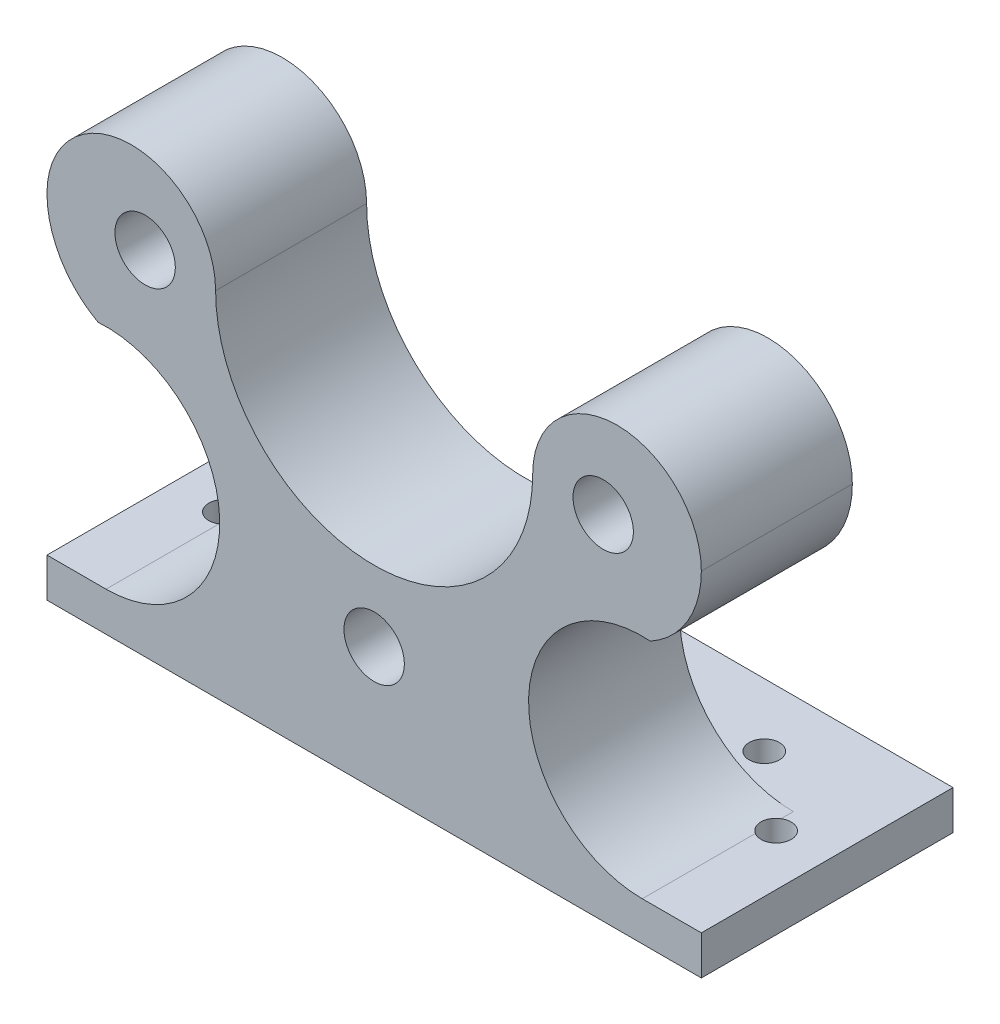
ISO-10303-21;
HEADER;
FILE_DESCRIPTION(('STEP AP214'),'2;1');
FILE_NAME('part.step','',(''),(''),'','','');
FILE_SCHEMA(('AUTOMOTIVE_DESIGN { 1 0 10303 214 1 1 1 1 }'));
ENDSEC;
DATA;
#1=APPLICATION_CONTEXT('core data for automotive mechanical design processes');
#2=APPLICATION_PROTOCOL_DEFINITION('international standard','automotive_design',2000,#1);
#3=PRODUCT_CONTEXT('',#1,'mechanical');
#4=PRODUCT('Part','Part','',(#3));
#5=PRODUCT_RELATED_PRODUCT_CATEGORY('part','',(#4));
#6=PRODUCT_DEFINITION_FORMATION('','',#4);
#7=PRODUCT_DEFINITION_CONTEXT('part definition',#1,'design');
#8=PRODUCT_DEFINITION('design','',#6,#7);
#9=PRODUCT_DEFINITION_SHAPE('','',#8);
#10=(LENGTH_UNIT() NAMED_UNIT(*) SI_UNIT(.MILLI.,.METRE.));
#11=(NAMED_UNIT(*) PLANE_ANGLE_UNIT() SI_UNIT($,.RADIAN.));
#12=(NAMED_UNIT(*) SI_UNIT($,.STERADIAN.) SOLID_ANGLE_UNIT());
#13=UNCERTAINTY_MEASURE_WITH_UNIT(LENGTH_MEASURE(1.E-05),#10,'distance_accuracy_value','');
#14=(GEOMETRIC_REPRESENTATION_CONTEXT(3) GLOBAL_UNCERTAINTY_ASSIGNED_CONTEXT((#13)) GLOBAL_UNIT_ASSIGNED_CONTEXT((#10,
#11,#12)) REPRESENTATION_CONTEXT('',''));
#15=CARTESIAN_POINT('',(0.,0.,0.));
#16=DIRECTION('',(0.,0.,1.));
#17=DIRECTION('',(1.,0.,0.));
#18=AXIS2_PLACEMENT_3D('',#15,#16,#17);
#19=CARTESIAN_POINT('',(11.0715289728421,25.574190109034,45.));
#20=DIRECTION('',(0.,0.,-1.));
#21=DIRECTION('',(-1.,0.,0.));
#22=AXIS2_PLACEMENT_3D('',#19,#20,#21);
#23=CYLINDRICAL_SURFACE('',#22,11.2958315426283);
#24=DIRECTION('',(0.,0.,-1.));
#25=VECTOR('',#24,1.);
#26=CARTESIAN_POINT('',(11.0715289728421,14.2783585664057,45.));
#27=LINE('',#26,#25);
#28=CARTESIAN_POINT('',(11.0715289728421,14.2783585664057,11.2287877429507));
#29=VERTEX_POINT('',#28);
#30=CARTESIAN_POINT('',(11.0715289728421,14.2783585664057,10.));
#31=VERTEX_POINT('',#30);
#32=EDGE_CURVE('E149',#29,#31,#27,.T.);
#33=ORIENTED_EDGE('',*,*,#32,.T.);
#34=CARTESIAN_POINT('',(11.0715289728421,25.574190109034,10.));
#35=DIRECTION('',(0.,0.,1.));
#36=DIRECTION('',(1.,0.,0.));
#37=AXIS2_PLACEMENT_3D('',#34,#35,#36);
#38=CIRCLE('',#37,11.2958315426283);
#39=CARTESIAN_POINT('',(11.8677823229309,36.8419223938334,10.));
#40=VERTEX_POINT('',#39);
#41=EDGE_CURVE('E131',#31,#40,#38,.F.);
#42=ORIENTED_EDGE('',*,*,#41,.T.);
#43=DIRECTION('',(0.,0.,-1.));
#44=VECTOR('',#43,1.);
#45=CARTESIAN_POINT('',(11.8677823229309,36.8419223938334,45.));
#46=LINE('',#45,#44);
#47=CARTESIAN_POINT('',(11.8677823229309,36.8419223938334,25.));
#48=VERTEX_POINT('',#47);
#49=EDGE_CURVE('E161',#48,#40,#46,.T.);
#50=ORIENTED_EDGE('',*,*,#49,.F.);
#51=CARTESIAN_POINT('',(11.0715289728421,25.574190109034,25.));
#52=DIRECTION('',(0.,0.,1.));
#53=DIRECTION('',(1.,0.,0.));
#54=AXIS2_PLACEMENT_3D('',#51,#52,#53);
#55=CIRCLE('',#54,11.2958315426283);
#56=CARTESIAN_POINT('',(11.0715289728421,14.2783585664057,25.));
#57=VERTEX_POINT('',#56);
#58=EDGE_CURVE('E168',#48,#57,#55,.T.);
#59=ORIENTED_EDGE('',*,*,#58,.T.);
#60=CARTESIAN_POINT('',(11.0715289728421,14.2783585664057,13.7712122570493));
#61=VERTEX_POINT('',#60);
#62=EDGE_CURVE('E156',#57,#61,#27,.T.);
#63=ORIENTED_EDGE('',*,*,#62,.T.);
#64=CARTESIAN_POINT('',(13.367782322931,14.5142158418107,12.5));
#65=CARTESIAN_POINT('',(13.36777868795,14.5142142885056,12.4168096975628));
#66=CARTESIAN_POINT('',(13.3608368416691,14.5127667985091,12.3335681071057));
#67=CARTESIAN_POINT('',(13.3332716775662,14.5070983383417,12.1694226656716));
#68=CARTESIAN_POINT('',(13.3126342414888,14.5028745061896,12.0885213170657));
#69=CARTESIAN_POINT('',(13.2583477514413,14.4920245046222,11.9314743567562));
#70=CARTESIAN_POINT('',(13.2247121343282,14.4854008164958,11.8553239279031));
#71=CARTESIAN_POINT('',(13.145441165567,14.4703025502605,11.7097744644635));
#72=CARTESIAN_POINT('',(13.099807313348,14.4618282034524,11.6403745877387));
#73=CARTESIAN_POINT('',(12.99720504872,14.4435871573464,11.5093374114208));
#74=CARTESIAN_POINT('',(12.9401054458047,14.4338059844281,11.4478048682389));
#75=CARTESIAN_POINT('',(12.8165039918263,14.413778584714,11.3351299658346));
#76=CARTESIAN_POINT('',(12.7500011149072,14.4035323072602,11.2839887417451));
#77=CARTESIAN_POINT('',(12.6083627891712,14.3831608240557,11.1928140816024));
#78=CARTESIAN_POINT('',(12.5331165465115,14.3730395034573,11.1529517173842));
#79=CARTESIAN_POINT('',(12.376864948461,14.3537579196483,11.0864785833415));
#80=CARTESIAN_POINT('',(12.2958596449166,14.3445976477875,11.0598676942365));
#81=CARTESIAN_POINT('',(12.1305493957066,14.3278054215694,11.0207601023054));
#82=CARTESIAN_POINT('',(12.0462523349479,14.3201700543344,11.0082315839997));
#83=CARTESIAN_POINT('',(11.8766077702759,14.3067638240528,10.9976207223943));
#84=CARTESIAN_POINT('',(11.79126034704,14.3009928187224,10.9995372764078));
#85=CARTESIAN_POINT('',(11.6230250360962,14.2915184801758,11.0177155581488));
#86=CARTESIAN_POINT('',(11.5401199563665,14.2877913154426,11.033805982951));
#87=CARTESIAN_POINT('',(11.3781223461907,14.282229126694,11.079676359529));
#88=CARTESIAN_POINT('',(11.2990296959155,14.2803940431712,11.1094558807305));
#89=CARTESIAN_POINT('',(11.1473897110663,14.2783599519893,11.1816504726813));
#90=CARTESIAN_POINT('',(11.0748067198463,14.2781514150256,11.2239904369579));
#91=CARTESIAN_POINT('',(10.9377182855837,14.2789428256362,11.3201727611532));
#92=CARTESIAN_POINT('',(10.8732130136762,14.2799427988092,11.3740153647021));
#93=CARTESIAN_POINT('',(10.7538773499604,14.2826671531296,11.4918955350269));
#94=CARTESIAN_POINT('',(10.6990817063519,14.2843940642509,11.5559682176005));
#95=CARTESIAN_POINT('',(10.6009780428907,14.2880566047364,11.6923708852634));
#96=CARTESIAN_POINT('',(10.5576702618555,14.2899922384385,11.76470104197));
#97=CARTESIAN_POINT('',(10.4836114591308,14.293607232093,11.9158901404263));
#98=CARTESIAN_POINT('',(10.4529107013103,14.2952855497958,11.9947737372468));
#99=CARTESIAN_POINT('',(10.4051881451433,14.2980038663792,12.1565858364018));
#100=CARTESIAN_POINT('',(10.3881662177409,14.299043871282,12.2395143005663));
#101=CARTESIAN_POINT('',(10.3682979953364,14.3002654396496,12.4069880098182));
#102=CARTESIAN_POINT('',(10.3654397709818,14.3004477255201,12.4915318340951));
#103=CARTESIAN_POINT('',(10.3739491054947,14.2999180763214,12.6598972217294));
#104=CARTESIAN_POINT('',(10.3853166052538,14.2992061449677,12.7437187880864));
#105=CARTESIAN_POINT('',(10.4219284409483,14.2970379245,12.9081587554434));
#106=CARTESIAN_POINT('',(10.4471563069577,14.2955825189816,12.988780836632));
#107=CARTESIAN_POINT('',(10.5107598231519,14.2922418583411,13.1446514387808));
#108=CARTESIAN_POINT('',(10.5491357052309,14.2903565956377,13.2198998649363));
#109=CARTESIAN_POINT('',(10.6380277984844,14.2865924149611,13.3630251613459));
#110=CARTESIAN_POINT('',(10.6885644396562,14.2847135131187,13.4308893445012));
#111=CARTESIAN_POINT('',(10.8003189637183,14.2814768945834,13.5571809245423));
#112=CARTESIAN_POINT('',(10.8615368481038,14.2801191779636,13.6156083201071));
#113=CARTESIAN_POINT('',(10.9929126429103,14.2784415162526,13.7213567576014));
#114=CARTESIAN_POINT('',(11.0630692420608,14.278121419129,13.7686794256583));
#115=CARTESIAN_POINT('',(11.2103233914455,14.278971676898,13.8508726364954));
#116=CARTESIAN_POINT('',(11.2874206553512,14.2801419703326,13.8857436926566));
#117=CARTESIAN_POINT('',(11.4459535455408,14.2842889061009,13.9419080663174));
#118=CARTESIAN_POINT('',(11.5273668915304,14.2872569656884,13.9632649177105));
#119=CARTESIAN_POINT('',(11.6925230052354,14.2951383656656,13.9920827019706));
#120=CARTESIAN_POINT('',(11.7762657290574,14.3000516694233,13.9995438964989));
#121=CARTESIAN_POINT('',(11.9435309865145,14.3117552547383,14.0004146690366));
#122=CARTESIAN_POINT('',(12.0270536386264,14.3185420002626,13.9938505633515));
#123=CARTESIAN_POINT('',(12.1917055805066,14.3337339954799,13.966980908463));
#124=CARTESIAN_POINT('',(12.2728347506946,14.3421393258813,13.9466746739016));
#125=CARTESIAN_POINT('',(12.431134919588,14.3601950802416,13.8927252943959));
#126=CARTESIAN_POINT('',(12.508267921147,14.3698551665855,13.8589739431991));
#127=CARTESIAN_POINT('',(12.6557621643802,14.3897562534661,13.7791099235118));
#128=CARTESIAN_POINT('',(12.7261230494807,14.3999972845463,13.7329966046073));
#129=CARTESIAN_POINT('',(12.8589190474897,14.4204634879145,13.6290859579353));
#130=CARTESIAN_POINT('',(12.9212566478686,14.4306872000698,13.5711636458613));
#131=CARTESIAN_POINT('',(13.0353371370992,14.4502238002261,13.445524124467));
#132=CARTESIAN_POINT('',(13.0870777187324,14.459536489646,13.3778047875704));
#133=CARTESIAN_POINT('',(13.1783928234434,14.4764833106209,13.2345153290488));
#134=CARTESIAN_POINT('',(13.2179793985239,14.4841191028456,13.1589530846738));
#135=CARTESIAN_POINT('',(13.283801816805,14.4970607403392,13.0021007134265));
#136=CARTESIAN_POINT('',(13.3100533623082,14.502369324934,12.9208174522541));
#137=CARTESIAN_POINT('',(13.3420231690733,14.5088917519666,12.7825697723459));
#138=CARTESIAN_POINT('',(13.3516677546521,14.5108804337476,12.7265181401306));
#139=CARTESIAN_POINT('',(13.3645485088366,14.513542996067,12.6136523088351));
#140=CARTESIAN_POINT('',(13.3677848064596,14.5142169030756,12.5568381251305));
#141=CARTESIAN_POINT('',(13.367782322931,14.5142158418107,12.5));
#142=B_SPLINE_CURVE_WITH_KNOTS('',3,(#64,#65,#66,#67,#68,#69,#70,#71,#72,#73,#74,#75,#76,#77,
#78,#79,#80,#81,#82,#83,#84,#85,#86,#87,#88,#89,#90,#91,#92,#93,#94,#95,#96,#97,#98,#99,#100,
#101,#102,#103,#104,#105,#106,#107,#108,#109,#110,#111,#112,#113,#114,#115,#116,#117,#118,#119,
#120,#121,#122,#123,#124,#125,#126,#127,#128,#129,#130,#131,#132,#133,#134,#135,#136,#137,#138,
#139,#140,#141),.UNSPECIFIED.,.T.,.F.,(4,2,2,2,2,2,2,2,2,2,2,2,2,2,2,2,2,2,2,2,2,2,2,2,2,2,2,2,
2,2,2,2,2,2,2,2,2,2,4),(0.,0.249361564379548,0.498980586119287,0.748342251755096,
0.997672769265135,1.25003782667589,1.50243043727811,1.75846783252684,2.01450292306539,
2.26995839843876,2.52539437342315,2.77778491013553,3.03016750874542,3.28107037687447,
3.53197855974534,3.78376729802155,4.03556127024276,4.28834961314605,4.54113557103496,
4.79370858419091,5.04628054789606,5.29855303375483,5.55082996922534,5.80353372419595,
6.05623751454271,6.3089042769369,6.56156062065436,6.81302015753371,7.06447495926977,
7.31545835936135,7.56645427761148,7.81951239611179,8.07258383165316,8.32848747813792,
8.58444678173409,8.84015144828325,9.095554314673,9.26592909082381,9.43630043680658),.UNSPECIFIED.);
#143=EDGE_CURVE('E54',#29,#61,#142,.T.);
#144=ORIENTED_EDGE('',*,*,#143,.F.);
#145=EDGE_LOOP('',(#33,#42,#50,#59,#63,#144));
#146=FACE_BOUND('',#145,.T.);
#147=ADVANCED_FACE('F33',(#146),#23,.F.);
#148=CARTESIAN_POINT('',(0.,0.,25.));
#149=DIRECTION('',(0.,0.,1.));
#150=DIRECTION('',(1.,0.,0.));
#151=AXIS2_PLACEMENT_3D('',#148,#149,#150);
#152=PLANE('',#151);
#153=CARTESIAN_POINT('',(7.18719074971738,45.3949664440392,25.));
#154=DIRECTION('',(0.,0.,1.));
#155=DIRECTION('',(1.,0.,0.));
#156=AXIS2_PLACEMENT_3D('',#153,#154,#155);
#157=CIRCLE('',#156,3.);
#158=CARTESIAN_POINT('',(10.1871907497174,45.3949664440392,25.));
#159=VERTEX_POINT('',#158);
#160=EDGE_CURVE('E207',#159,#159,#157,.T.);
#161=ORIENTED_EDGE('',*,*,#160,.F.);
#162=EDGE_LOOP('',(#161));
#163=FACE_BOUND('',#162,.T.);
#164=CARTESIAN_POINT('',(-15.5628092502824,22.6449664440393,25.));
#165=DIRECTION('',(0.,0.,1.));
#166=DIRECTION('',(0.,-1.,0.));
#167=AXIS2_PLACEMENT_3D('',#164,#165,#166);
#168=CIRCLE('',#167,3.);
#169=CARTESIAN_POINT('',(-15.5628092502824,19.6449664440392,25.));
#170=VERTEX_POINT('',#169);
#171=EDGE_CURVE('E198',#170,#170,#168,.T.);
#172=ORIENTED_EDGE('',*,*,#171,.F.);
#173=EDGE_LOOP('',(#172));
#174=FACE_BOUND('',#173,.T.);
#175=CARTESIAN_POINT('',(-38.3128092502826,45.3949664440393,25.));
#176=DIRECTION('',(0.,0.,1.));
#177=DIRECTION('',(-1.,0.,0.));
#178=AXIS2_PLACEMENT_3D('',#175,#176,#177);
#179=CIRCLE('',#178,3.);
#180=CARTESIAN_POINT('',(-41.3128092502826,45.3949664440393,25.));
#181=VERTEX_POINT('',#180);
#182=EDGE_CURVE('E204',#181,#181,#179,.T.);
#183=ORIENTED_EDGE('',*,*,#182,.F.);
#184=EDGE_LOOP('',(#183));
#185=FACE_BOUND('',#184,.T.);
#186=DIRECTION('',(1.,0.,0.));
#187=VECTOR('',#186,1.);
#188=CARTESIAN_POINT('',(0.,14.2783585664057,25.));
#189=LINE('',#188,#187);
#190=CARTESIAN_POINT('',(16.9371907497174,14.2783585664057,25.));
#191=VERTEX_POINT('',#190);
#192=EDGE_CURVE('E166',#57,#191,#189,.T.);
#193=ORIENTED_EDGE('',*,*,#192,.F.);
#194=ORIENTED_EDGE('',*,*,#58,.F.);
#195=CARTESIAN_POINT('',(7.18719074971739,45.3949664440393,25.));
#196=DIRECTION('',(0.,0.,1.));
#197=DIRECTION('',(1.,0.,0.));
#198=AXIS2_PLACEMENT_3D('',#195,#196,#197);
#199=CIRCLE('',#198,9.74999999999999);
#200=CARTESIAN_POINT('',(16.9371907497174,45.3949664440393,25.));
#201=VERTEX_POINT('',#200);
#202=EDGE_CURVE('E159',#201,#48,#199,.F.);
#203=ORIENTED_EDGE('',*,*,#202,.F.);
#204=CARTESIAN_POINT('',(8.56219074971738,45.3949664440393,25.));
#205=DIRECTION('',(0.,0.,-1.));
#206=DIRECTION('',(-1.,0.,0.));
#207=AXIS2_PLACEMENT_3D('',#204,#205,#206);
#208=CIRCLE('',#207,8.37500000000001);
#209=CARTESIAN_POINT('',(0.187190749717379,45.3949664440392,25.));
#210=VERTEX_POINT('',#209);
#211=EDGE_CURVE('E192',#210,#201,#208,.T.);
#212=ORIENTED_EDGE('',*,*,#211,.F.);
#213=CARTESIAN_POINT('',(-15.5628092502826,45.3949664440392,25.));
#214=DIRECTION('',(0.,0.,1.));
#215=DIRECTION('',(1.,0.,0.));
#216=AXIS2_PLACEMENT_3D('',#213,#214,#215);
#217=CIRCLE('',#216,15.75);
#218=CARTESIAN_POINT('',(-31.3128092502826,45.3949664440392,25.));
#219=VERTEX_POINT('',#218);
#220=EDGE_CURVE('E212',#219,#210,#217,.T.);
#221=ORIENTED_EDGE('',*,*,#220,.F.);
#222=CARTESIAN_POINT('',(-39.6878092502826,45.3949664440392,25.));
#223=DIRECTION('',(0.,0.,-1.));
#224=DIRECTION('',(1.,0.,0.));
#225=AXIS2_PLACEMENT_3D('',#222,#223,#224);
#226=CIRCLE('',#225,8.37499999999999);
#227=CARTESIAN_POINT('',(-48.0628092502826,45.3949664440393,25.));
#228=VERTEX_POINT('',#227);
#229=EDGE_CURVE('E189',#228,#219,#226,.T.);
#230=ORIENTED_EDGE('',*,*,#229,.F.);
#231=CARTESIAN_POINT('',(-38.3128092502826,45.3949664440393,25.));
#232=DIRECTION('',(0.,0.,1.));
#233=DIRECTION('',(1.,0.,0.));
#234=AXIS2_PLACEMENT_3D('',#231,#232,#233);
#235=CIRCLE('',#234,9.74999999999999);
#236=CARTESIAN_POINT('',(-42.9934008234962,36.8419223938334,25.));
#237=VERTEX_POINT('',#236);
#238=EDGE_CURVE('E180',#228,#237,#235,.T.);
#239=ORIENTED_EDGE('',*,*,#238,.T.);
#240=CARTESIAN_POINT('',(-42.1971474734074,25.574190109034,25.));
#241=DIRECTION('',(0.,0.,1.));
#242=DIRECTION('',(1.,0.,0.));
#243=AXIS2_PLACEMENT_3D('',#240,#241,#242);
#244=CIRCLE('',#243,11.2958315426283);
#245=CARTESIAN_POINT('',(-42.1971474734074,14.2783585664057,25.));
#246=VERTEX_POINT('',#245);
#247=EDGE_CURVE('E186',#237,#246,#244,.F.);
#248=ORIENTED_EDGE('',*,*,#247,.T.);
#249=DIRECTION('',(-1.,0.,0.));
#250=VECTOR('',#249,1.);
#251=CARTESIAN_POINT('',(0.,14.2783585664057,25.));
#252=LINE('',#251,#250);
#253=CARTESIAN_POINT('',(-48.0628092502826,14.2783585664057,25.));
#254=VERTEX_POINT('',#253);
#255=EDGE_CURVE('E183',#246,#254,#252,.T.);
#256=ORIENTED_EDGE('',*,*,#255,.T.);
#257=DIRECTION('',(0.,-1.,0.));
#258=VECTOR('',#257,1.);
#259=CARTESIAN_POINT('',(-48.0628092502826,80.3949664440393,25.));
#260=LINE('',#259,#258);
#261=CARTESIAN_POINT('',(-48.0628092502826,10.3949664440393,25.));
#262=VERTEX_POINT('',#261);
#263=EDGE_CURVE('E216',#254,#262,#260,.T.);
#264=ORIENTED_EDGE('',*,*,#263,.T.);
#265=DIRECTION('',(1.,0.,0.));
#266=VECTOR('',#265,1.);
#267=CARTESIAN_POINT('',(-48.0628092502826,10.3949664440393,25.));
#268=LINE('',#267,#266);
#269=CARTESIAN_POINT('',(16.9371907497174,10.3949664440393,25.));
#270=VERTEX_POINT('',#269);
#271=EDGE_CURVE('E218',#262,#270,#268,.T.);
#272=ORIENTED_EDGE('',*,*,#271,.T.);
#273=DIRECTION('',(0.,1.,0.));
#274=VECTOR('',#273,1.);
#275=CARTESIAN_POINT('',(16.9371907497174,80.3949664440393,25.));
#276=LINE('',#275,#274);
#277=EDGE_CURVE('E221',#270,#191,#276,.T.);
#278=ORIENTED_EDGE('',*,*,#277,.T.);
#279=EDGE_LOOP('',(#193,#194,#203,#212,#221,#230,#239,#248,#256,#264,#272,#278));
#280=FACE_BOUND('',#279,.T.);
#281=ADVANCED_FACE('F353',(#163,#174,#185,#280),#152,.T.);
#282=CARTESIAN_POINT('',(0.,0.,0.));
#283=DIRECTION('',(0.,0.,1.));
#284=DIRECTION('',(1.,0.,0.));
#285=AXIS2_PLACEMENT_3D('',#282,#283,#284);
#286=PLANE('',#285);
#287=DIRECTION('',(1.,0.,0.));
#288=VECTOR('',#287,1.);
#289=CARTESIAN_POINT('',(-42.1971474734074,14.2783585664057,0.));
#290=LINE('',#289,#288);
#291=CARTESIAN_POINT('',(-48.0628092502826,14.2783585664057,0.));
#292=VERTEX_POINT('',#291);
#293=CARTESIAN_POINT('',(16.9371907497174,14.2783585664057,0.));
#294=VERTEX_POINT('',#293);
#295=EDGE_CURVE('E170',#292,#294,#290,.T.);
#296=ORIENTED_EDGE('',*,*,#295,.T.);
#297=DIRECTION('',(0.,1.,0.));
#298=VECTOR('',#297,1.);
#299=CARTESIAN_POINT('',(16.9371907497174,80.3949664440393,0.));
#300=LINE('',#299,#298);
#301=CARTESIAN_POINT('',(16.9371907497174,10.3949664440393,0.));
#302=VERTEX_POINT('',#301);
#303=EDGE_CURVE('E219',#302,#294,#300,.T.);
#304=ORIENTED_EDGE('',*,*,#303,.F.);
#305=DIRECTION('',(1.,0.,0.));
#306=VECTOR('',#305,1.);
#307=CARTESIAN_POINT('',(-48.0628092502826,10.3949664440393,0.));
#308=LINE('',#307,#306);
#309=CARTESIAN_POINT('',(-48.0628092502826,10.3949664440393,0.));
#310=VERTEX_POINT('',#309);
#311=EDGE_CURVE('E226',#310,#302,#308,.T.);
#312=ORIENTED_EDGE('',*,*,#311,.F.);
#313=DIRECTION('',(0.,-1.,0.));
#314=VECTOR('',#313,1.);
#315=CARTESIAN_POINT('',(-48.0628092502826,80.3949664440393,0.));
#316=LINE('',#315,#314);
#317=EDGE_CURVE('E215',#292,#310,#316,.T.);
#318=ORIENTED_EDGE('',*,*,#317,.F.);
#319=EDGE_LOOP('',(#296,#304,#312,#318));
#320=FACE_BOUND('',#319,.T.);
#321=ADVANCED_FACE('F356',(#320),#286,.F.);
#322=CARTESIAN_POINT('',(-48.0628092502826,80.3949664440393,25.));
#323=DIRECTION('',(1.,0.,0.));
#324=DIRECTION('',(0.,0.,-1.));
#325=AXIS2_PLACEMENT_3D('',#322,#323,#324);
#326=PLANE('',#325);
#327=DIRECTION('',(0.,0.,-1.));
#328=VECTOR('',#327,1.);
#329=CARTESIAN_POINT('',(-48.0628092502826,14.2783585664057,45.));
#330=LINE('',#329,#328);
#331=EDGE_CURVE('E175',#254,#292,#330,.T.);
#332=ORIENTED_EDGE('',*,*,#331,.T.);
#333=ORIENTED_EDGE('',*,*,#317,.T.);
#334=DIRECTION('',(0.,0.,-1.));
#335=VECTOR('',#334,1.);
#336=CARTESIAN_POINT('',(-48.0628092502826,10.3949664440393,25.));
#337=LINE('',#336,#335);
#338=EDGE_CURVE('E232',#262,#310,#337,.T.);
#339=ORIENTED_EDGE('',*,*,#338,.F.);
#340=ORIENTED_EDGE('',*,*,#263,.F.);
#341=EDGE_LOOP('',(#332,#333,#339,#340));
#342=FACE_BOUND('',#341,.T.);
#343=ADVANCED_FACE('F35',(#342),#326,.F.);
#344=CARTESIAN_POINT('',(16.9371907497174,80.3949664440393,25.));
#345=DIRECTION('',(-1.,0.,0.));
#346=DIRECTION('',(0.,-1.,0.));
#347=AXIS2_PLACEMENT_3D('',#344,#345,#346);
#348=PLANE('',#347);
#349=ORIENTED_EDGE('',*,*,#303,.T.);
#350=DIRECTION('',(0.,0.,-1.));
#351=VECTOR('',#350,1.);
#352=CARTESIAN_POINT('',(16.9371907497174,14.2783585664057,45.));
#353=LINE('',#352,#351);
#354=EDGE_CURVE('E157',#191,#294,#353,.T.);
#355=ORIENTED_EDGE('',*,*,#354,.F.);
#356=ORIENTED_EDGE('',*,*,#277,.F.);
#357=DIRECTION('',(0.,0.,-1.));
#358=VECTOR('',#357,1.);
#359=CARTESIAN_POINT('',(16.9371907497174,10.3949664440393,25.));
#360=LINE('',#359,#358);
#361=EDGE_CURVE('E224',#270,#302,#360,.T.);
#362=ORIENTED_EDGE('',*,*,#361,.T.);
#363=EDGE_LOOP('',(#349,#355,#356,#362));
#364=FACE_BOUND('',#363,.T.);
#365=ADVANCED_FACE('F361',(#364),#348,.F.);
#366=CARTESIAN_POINT('',(-48.0628092502826,10.3949664440393,25.));
#367=DIRECTION('',(0.,1.,0.));
#368=DIRECTION('',(0.,0.,1.));
#369=AXIS2_PLACEMENT_3D('',#366,#367,#368);
#370=PLANE('',#369);
#371=CARTESIAN_POINT('',(4.4371907497174,10.3949664440393,6.25));
#372=DIRECTION('',(0.,1.,0.));
#373=DIRECTION('',(0.,0.,-1.));
#374=AXIS2_PLACEMENT_3D('',#371,#372,#373);
#375=CIRCLE('',#374,1.5);
#376=CARTESIAN_POINT('',(4.4371907497174,10.3949664440393,4.75));
#377=VERTEX_POINT('',#376);
#378=EDGE_CURVE('E264',#377,#377,#375,.T.);
#379=ORIENTED_EDGE('',*,*,#378,.T.);
#380=EDGE_LOOP('',(#379));
#381=FACE_BOUND('',#380,.T.);
#382=CARTESIAN_POINT('',(-3.06280925028261,10.3949664440393,12.5));
#383=DIRECTION('',(0.,1.,0.));
#384=DIRECTION('',(0.,0.,-1.));
#385=AXIS2_PLACEMENT_3D('',#382,#383,#384);
#386=CIRCLE('',#385,1.25);
#387=CARTESIAN_POINT('',(-3.06280925028261,10.3949664440393,11.25));
#388=VERTEX_POINT('',#387);
#389=EDGE_CURVE('E270',#388,#388,#386,.T.);
#390=ORIENTED_EDGE('',*,*,#389,.T.);
#391=EDGE_LOOP('',(#390));
#392=FACE_BOUND('',#391,.T.);
#393=CARTESIAN_POINT('',(11.867782322931,10.3949664440393,12.5));
#394=DIRECTION('',(0.,1.,0.));
#395=DIRECTION('',(0.,0.,-1.));
#396=AXIS2_PLACEMENT_3D('',#393,#394,#395);
#397=CIRCLE('',#396,1.5);
#398=CARTESIAN_POINT('',(11.867782322931,10.3949664440393,11.));
#399=VERTEX_POINT('',#398);
#400=EDGE_CURVE('E263',#399,#399,#397,.T.);
#401=ORIENTED_EDGE('',*,*,#400,.T.);
#402=EDGE_LOOP('',(#401));
#403=FACE_BOUND('',#402,.T.);
#404=CARTESIAN_POINT('',(-35.5628092502826,10.3949664440393,6.25));
#405=DIRECTION('',(0.,-1.,0.));
#406=DIRECTION('',(0.,0.,-1.));
#407=AXIS2_PLACEMENT_3D('',#404,#405,#406);
#408=CIRCLE('',#407,1.5);
#409=CARTESIAN_POINT('',(-35.5628092502826,10.3949664440393,4.75));
#410=VERTEX_POINT('',#409);
#411=EDGE_CURVE('E282',#410,#410,#408,.T.);
#412=ORIENTED_EDGE('',*,*,#411,.F.);
#413=EDGE_LOOP('',(#412));
#414=FACE_BOUND('',#413,.T.);
#415=CARTESIAN_POINT('',(-28.0628092502826,10.3949664440393,12.5));
#416=DIRECTION('',(0.,-1.,0.));
#417=DIRECTION('',(0.,0.,-1.));
#418=AXIS2_PLACEMENT_3D('',#415,#416,#417);
#419=CIRCLE('',#418,1.25);
#420=CARTESIAN_POINT('',(-28.0628092502826,10.3949664440393,11.25));
#421=VERTEX_POINT('',#420);
#422=EDGE_CURVE('E552',#421,#421,#419,.T.);
#423=ORIENTED_EDGE('',*,*,#422,.F.);
#424=EDGE_LOOP('',(#423));
#425=FACE_BOUND('',#424,.T.);
#426=CARTESIAN_POINT('',(-42.9934008234962,10.3949664440393,12.5));
#427=DIRECTION('',(0.,-1.,0.));
#428=DIRECTION('',(0.,0.,-1.));
#429=AXIS2_PLACEMENT_3D('',#426,#427,#428);
#430=CIRCLE('',#429,1.5);
#431=CARTESIAN_POINT('',(-42.9934008234962,10.3949664440393,11.));
#432=VERTEX_POINT('',#431);
#433=EDGE_CURVE('E281',#432,#432,#430,.T.);
#434=ORIENTED_EDGE('',*,*,#433,.F.);
#435=EDGE_LOOP('',(#434));
#436=FACE_BOUND('',#435,.T.);
#437=ORIENTED_EDGE('',*,*,#311,.T.);
#438=ORIENTED_EDGE('',*,*,#361,.F.);
#439=ORIENTED_EDGE('',*,*,#271,.F.);
#440=ORIENTED_EDGE('',*,*,#338,.T.);
#441=EDGE_LOOP('',(#437,#438,#439,#440));
#442=FACE_BOUND('',#441,.T.);
#443=ADVANCED_FACE('F351',(#381,#392,#403,#414,#425,#436,#442),#370,.F.);
#444=CARTESIAN_POINT('',(-15.5628092502826,45.3949664440392,0.));
#445=DIRECTION('',(0.,0.,1.));
#446=DIRECTION('',(1.,0.,0.));
#447=AXIS2_PLACEMENT_3D('',#444,#445,#446);
#448=CYLINDRICAL_SURFACE('',#447,15.75);
#449=DIRECTION('',(0.,0.,1.));
#450=VECTOR('',#449,1.);
#451=CARTESIAN_POINT('',(0.187190749717379,45.3949664440392,0.));
#452=LINE('',#451,#450);
#453=CARTESIAN_POINT('',(0.187190749717379,45.3949664440392,10.));
#454=VERTEX_POINT('',#453);
#455=EDGE_CURVE('E201',#454,#210,#452,.T.);
#456=ORIENTED_EDGE('',*,*,#455,.F.);
#457=CARTESIAN_POINT('',(-15.5628092502826,45.3949664440392,10.));
#458=DIRECTION('',(0.,0.,1.));
#459=DIRECTION('',(1.,0.,0.));
#460=AXIS2_PLACEMENT_3D('',#457,#458,#459);
#461=CIRCLE('',#460,15.75);
#462=CARTESIAN_POINT('',(-31.3128092502826,45.3949664440392,10.));
#463=VERTEX_POINT('',#462);
#464=EDGE_CURVE('E142',#454,#463,#461,.F.);
#465=ORIENTED_EDGE('',*,*,#464,.T.);
#466=DIRECTION('',(0.,0.,1.));
#467=VECTOR('',#466,1.);
#468=CARTESIAN_POINT('',(-31.3128092502826,45.3949664440392,0.));
#469=LINE('',#468,#467);
#470=EDGE_CURVE('E195',#463,#219,#469,.T.);
#471=ORIENTED_EDGE('',*,*,#470,.T.);
#472=ORIENTED_EDGE('',*,*,#220,.T.);
#473=EDGE_LOOP('',(#456,#465,#471,#472));
#474=FACE_BOUND('',#473,.T.);
#475=ADVANCED_FACE('F347',(#474),#448,.F.);
#476=CARTESIAN_POINT('',(7.18719074971738,45.3949664440392,40.));
#477=DIRECTION('',(0.,0.,-1.));
#478=DIRECTION('',(-1.,0.,0.));
#479=AXIS2_PLACEMENT_3D('',#476,#477,#478);
#480=CYLINDRICAL_SURFACE('',#479,3.);
#481=CARTESIAN_POINT('',(7.18719074971738,45.3949664440392,10.));
#482=DIRECTION('',(0.,0.,1.));
#483=DIRECTION('',(1.,0.,0.));
#484=AXIS2_PLACEMENT_3D('',#481,#482,#483);
#485=CIRCLE('',#484,3.);
#486=CARTESIAN_POINT('',(10.1871907497174,45.3949664440392,10.));
#487=VERTEX_POINT('',#486);
#488=EDGE_CURVE('E260',#487,#487,#485,.F.);
#489=ORIENTED_EDGE('',*,*,#488,.T.);
#490=EDGE_LOOP('',(#489));
#491=FACE_BOUND('',#490,.T.);
#492=ORIENTED_EDGE('',*,*,#160,.T.);
#493=EDGE_LOOP('',(#492));
#494=FACE_BOUND('',#493,.T.);
#495=ADVANCED_FACE('F343',(#491,#494),#480,.F.);
#496=CARTESIAN_POINT('',(-15.5628092502824,22.6449664440393,40.));
#497=DIRECTION('',(0.,0.,-1.));
#498=DIRECTION('',(0.,1.,0.));
#499=AXIS2_PLACEMENT_3D('',#496,#497,#498);
#500=CYLINDRICAL_SURFACE('',#499,3.);
#501=CARTESIAN_POINT('',(-15.5628092502824,22.6449664440393,10.));
#502=DIRECTION('',(0.,0.,1.));
#503=DIRECTION('',(1.,0.,0.));
#504=AXIS2_PLACEMENT_3D('',#501,#502,#503);
#505=CIRCLE('',#504,3.);
#506=CARTESIAN_POINT('',(-12.5628092502824,22.6449664440393,10.));
#507=VERTEX_POINT('',#506);
#508=EDGE_CURVE('E257',#507,#507,#505,.F.);
#509=ORIENTED_EDGE('',*,*,#508,.T.);
#510=EDGE_LOOP('',(#509));
#511=FACE_BOUND('',#510,.T.);
#512=ORIENTED_EDGE('',*,*,#171,.T.);
#513=EDGE_LOOP('',(#512));
#514=FACE_BOUND('',#513,.T.);
#515=ADVANCED_FACE('F339',(#511,#514),#500,.F.);
#516=CARTESIAN_POINT('',(-38.3128092502826,45.3949664440393,40.));
#517=DIRECTION('',(0.,0.,-1.));
#518=DIRECTION('',(1.,0.,0.));
#519=AXIS2_PLACEMENT_3D('',#516,#517,#518);
#520=CYLINDRICAL_SURFACE('',#519,3.);
#521=CARTESIAN_POINT('',(-38.3128092502826,45.3949664440393,10.));
#522=DIRECTION('',(0.,0.,1.));
#523=DIRECTION('',(1.,0.,0.));
#524=AXIS2_PLACEMENT_3D('',#521,#522,#523);
#525=CIRCLE('',#524,3.);
#526=CARTESIAN_POINT('',(-35.3128092502826,45.3949664440393,10.));
#527=VERTEX_POINT('',#526);
#528=EDGE_CURVE('E254',#527,#527,#525,.F.);
#529=ORIENTED_EDGE('',*,*,#528,.T.);
#530=EDGE_LOOP('',(#529));
#531=FACE_BOUND('',#530,.T.);
#532=ORIENTED_EDGE('',*,*,#182,.T.);
#533=EDGE_LOOP('',(#532));
#534=FACE_BOUND('',#533,.T.);
#535=ADVANCED_FACE('F335',(#531,#534),#520,.F.);
#536=CARTESIAN_POINT('',(-39.6878092502826,45.3949664440392,0.));
#537=DIRECTION('',(0.,0.,1.));
#538=DIRECTION('',(1.,0.,0.));
#539=AXIS2_PLACEMENT_3D('',#536,#537,#538);
#540=CYLINDRICAL_SURFACE('',#539,8.37499999999999);
#541=ORIENTED_EDGE('',*,*,#470,.F.);
#542=CARTESIAN_POINT('',(-39.6878092502826,45.3949664440392,10.));
#543=DIRECTION('',(0.,0.,1.));
#544=DIRECTION('',(1.,0.,0.));
#545=AXIS2_PLACEMENT_3D('',#542,#543,#544);
#546=CIRCLE('',#545,8.37499999999999);
#547=CARTESIAN_POINT('',(-48.0628092502826,45.3949664440393,10.));
#548=VERTEX_POINT('',#547);
#549=EDGE_CURVE('E141',#463,#548,#546,.T.);
#550=ORIENTED_EDGE('',*,*,#549,.T.);
#551=DIRECTION('',(0.,0.,1.));
#552=VECTOR('',#551,1.);
#553=CARTESIAN_POINT('',(-48.0628092502826,45.3949664440393,0.));
#554=LINE('',#553,#552);
#555=EDGE_CURVE('E196',#548,#228,#554,.T.);
#556=ORIENTED_EDGE('',*,*,#555,.T.);
#557=ORIENTED_EDGE('',*,*,#229,.T.);
#558=EDGE_LOOP('',(#541,#550,#556,#557));
#559=FACE_BOUND('',#558,.T.);
#560=ADVANCED_FACE('F331',(#559),#540,.T.);
#561=CARTESIAN_POINT('',(8.56219074971738,45.3949664440393,0.));
#562=DIRECTION('',(0.,0.,1.));
#563=DIRECTION('',(1.,0.,0.));
#564=AXIS2_PLACEMENT_3D('',#561,#562,#563);
#565=CYLINDRICAL_SURFACE('',#564,8.37500000000001);
#566=DIRECTION('',(0.,0.,1.));
#567=VECTOR('',#566,1.);
#568=CARTESIAN_POINT('',(16.9371907497174,45.3949664440393,0.));
#569=LINE('',#568,#567);
#570=CARTESIAN_POINT('',(16.9371907497174,45.3949664440393,10.));
#571=VERTEX_POINT('',#570);
#572=EDGE_CURVE('E199',#571,#201,#569,.T.);
#573=ORIENTED_EDGE('',*,*,#572,.F.);
#574=CARTESIAN_POINT('',(8.56219074971738,45.3949664440393,10.));
#575=DIRECTION('',(0.,0.,1.));
#576=DIRECTION('',(1.,0.,0.));
#577=AXIS2_PLACEMENT_3D('',#574,#575,#576);
#578=CIRCLE('',#577,8.37500000000001);
#579=EDGE_CURVE('E48',#571,#454,#578,.T.);
#580=ORIENTED_EDGE('',*,*,#579,.T.);
#581=ORIENTED_EDGE('',*,*,#455,.T.);
#582=ORIENTED_EDGE('',*,*,#211,.T.);
#583=EDGE_LOOP('',(#573,#580,#581,#582));
#584=FACE_BOUND('',#583,.T.);
#585=ADVANCED_FACE('F327',(#584),#565,.T.);
#586=CARTESIAN_POINT('',(-42.1971474734074,25.574190109034,45.));
#587=DIRECTION('',(0.,0.,-1.));
#588=DIRECTION('',(-1.,0.,0.));
#589=AXIS2_PLACEMENT_3D('',#586,#587,#588);
#590=CYLINDRICAL_SURFACE('',#589,11.2958315426283);
#591=CARTESIAN_POINT('',(-42.1971474734074,25.574190109034,10.));
#592=DIRECTION('',(0.,0.,1.));
#593=DIRECTION('',(1.,0.,0.));
#594=AXIS2_PLACEMENT_3D('',#591,#592,#593);
#595=CIRCLE('',#594,11.2958315426283);
#596=CARTESIAN_POINT('',(-42.1971474734074,14.2783585664057,10.));
#597=VERTEX_POINT('',#596);
#598=CARTESIAN_POINT('',(-42.9934008234962,36.8419223938334,10.));
#599=VERTEX_POINT('',#598);
#600=EDGE_CURVE('E252',#597,#599,#595,.T.);
#601=ORIENTED_EDGE('',*,*,#600,.F.);
#602=DIRECTION('',(0.,0.,-1.));
#603=VECTOR('',#602,1.);
#604=CARTESIAN_POINT('',(-42.1971474734074,14.2783585664057,45.));
#605=LINE('',#604,#603);
#606=CARTESIAN_POINT('',(-42.1971474734074,14.2783585664057,11.2287877429507));
#607=VERTEX_POINT('',#606);
#608=EDGE_CURVE('E152',#607,#597,#605,.T.);
#609=ORIENTED_EDGE('',*,*,#608,.F.);
#610=CARTESIAN_POINT('',(-42.1971474734074,14.2783585664057,13.7712122570493));
#611=CARTESIAN_POINT('',(-42.1614105046121,14.2783580166005,13.7488273460703));
#612=CARTESIAN_POINT('',(-42.1266353410617,14.2785282428232,13.7249457924023));
#613=CARTESIAN_POINT('',(-42.0592212478765,14.2791504719615,13.6743451231849));
#614=CARTESIAN_POINT('',(-42.0265821644304,14.2796024545641,13.6476262123072));
#615=CARTESIAN_POINT('',(-41.9322822892749,14.2812896068134,13.5635326931993));
#616=CARTESIAN_POINT('',(-41.8741217965633,14.2828563673076,13.502147797581));
#617=CARTESIAN_POINT('',(-41.7689316213653,14.2863547532307,13.3705092044522));
#618=CARTESIAN_POINT('',(-41.7219061184704,14.2882865151777,13.3002521918586));
#619=CARTESIAN_POINT('',(-41.6403017984676,14.2920180800389,13.1528506104802));
#620=CARTESIAN_POINT('',(-41.6057204989283,14.2938179092146,13.0757074192208));
#621=CARTESIAN_POINT('',(-41.5499465808318,14.2968797598222,12.9166015437083));
#622=CARTESIAN_POINT('',(-41.5287715920172,14.2981410723806,12.8346326676089));
#623=CARTESIAN_POINT('',(-41.5004835391702,14.2998531786197,12.6682774703672));
#624=CARTESIAN_POINT('',(-41.4933731741683,14.3003038167289,12.5838906883753));
#625=CARTESIAN_POINT('',(-41.493428587512,14.3003003714935,12.4152673825284));
#626=CARTESIAN_POINT('',(-41.5005698599445,14.299847841161,12.3310308496042));
#627=CARTESIAN_POINT('',(-41.5288700832722,14.2981352234015,12.1649733636043));
#628=CARTESIAN_POINT('',(-41.5500262475565,14.2968752965126,12.0831519337058));
#629=CARTESIAN_POINT('',(-41.6057498920092,14.2938163847623,11.9242280097782));
#630=CARTESIAN_POINT('',(-41.6403161812564,14.2920174477723,11.8471250974125));
#631=CARTESIAN_POINT('',(-41.7218781860748,14.2882877671027,11.6997965737769));
#632=CARTESIAN_POINT('',(-41.7688764746622,14.2863569961993,11.629572390306));
#633=CARTESIAN_POINT('',(-41.8740427450466,14.2828585902269,11.4979385816378));
#634=CARTESIAN_POINT('',(-41.9322151554202,14.2812910996801,11.4365324681756));
#635=CARTESIAN_POINT('',(-42.0265371846901,14.279603113154,11.3524112439619));
#636=CARTESIAN_POINT('',(-42.0591844168852,14.2791508957021,11.3256837528905));
#637=CARTESIAN_POINT('',(-42.1266160387337,14.2785283370794,11.2750674670907));
#638=CARTESIAN_POINT('',(-42.1614005808935,14.2783580160475,11.2511788752878));
#639=CARTESIAN_POINT('',(-42.1971474734074,14.2783585664057,11.2287877429507));
#640=B_SPLINE_CURVE_WITH_KNOTS('',3,(#610,#611,#612,#613,#614,#615,#616,#617,#618,#619,#620,
#621,#622,#623,#624,#625,#626,#627,#628,#629,#630,#631,#632,#633,#634,#635,#636,#637,#638,#639),
.UNSPECIFIED.,.F.,.F.,(4,2,2,2,2,2,2,2,2,2,2,2,2,2,4),(0.,0.126428078192766,0.252847042728315,
0.505275557113299,0.757798672527911,1.01027138541605,1.26307542242416,1.51592796834868,
1.76834610499254,2.02071406785534,2.27305962364697,2.52545744761197,2.77795551014864,
2.9044096049896,3.03087273338978),.UNSPECIFIED.);
#641=CARTESIAN_POINT('',(-42.1971474734074,14.2783585664057,13.7712122570493));
#642=VERTEX_POINT('',#641);
#643=EDGE_CURVE('E313',#642,#607,#640,.T.);
#644=ORIENTED_EDGE('',*,*,#643,.F.);
#645=EDGE_CURVE('E172',#246,#642,#605,.T.);
#646=ORIENTED_EDGE('',*,*,#645,.F.);
#647=ORIENTED_EDGE('',*,*,#247,.F.);
#648=DIRECTION('',(0.,0.,-1.));
#649=VECTOR('',#648,1.);
#650=CARTESIAN_POINT('',(-42.9934008234962,36.8419223938334,45.));
#651=LINE('',#650,#649);
#652=EDGE_CURVE('E177',#237,#599,#651,.T.);
#653=ORIENTED_EDGE('',*,*,#652,.T.);
#654=EDGE_LOOP('',(#601,#609,#644,#646,#647,#653));
#655=FACE_BOUND('',#654,.T.);
#656=ADVANCED_FACE('F321',(#655),#590,.F.);
#657=CARTESIAN_POINT('',(-38.3128092502826,45.3949664440393,45.));
#658=DIRECTION('',(0.,0.,-1.));
#659=DIRECTION('',(-1.,0.,0.));
#660=AXIS2_PLACEMENT_3D('',#657,#658,#659);
#661=CYLINDRICAL_SURFACE('',#660,9.74999999999999);
#662=CARTESIAN_POINT('',(-38.3128092502826,45.3949664440393,10.));
#663=DIRECTION('',(0.,0.,1.));
#664=DIRECTION('',(1.,0.,0.));
#665=AXIS2_PLACEMENT_3D('',#662,#663,#664);
#666=CIRCLE('',#665,9.74999999999999);
#667=EDGE_CURVE('E250',#599,#548,#666,.F.);
#668=ORIENTED_EDGE('',*,*,#667,.F.);
#669=ORIENTED_EDGE('',*,*,#652,.F.);
#670=ORIENTED_EDGE('',*,*,#238,.F.);
#671=ORIENTED_EDGE('',*,*,#555,.F.);
#672=EDGE_LOOP('',(#668,#669,#670,#671));
#673=FACE_BOUND('',#672,.T.);
#674=ADVANCED_FACE('F326',(#673),#661,.T.);
#675=CARTESIAN_POINT('',(-42.1971474734074,14.2783585664057,45.));
#676=DIRECTION('',(0.,1.,0.));
#677=DIRECTION('',(-1.,0.,0.));
#678=AXIS2_PLACEMENT_3D('',#675,#676,#677);
#679=PLANE('',#678);
#680=ORIENTED_EDGE('',*,*,#608,.T.);
#681=DIRECTION('',(-1.,0.,0.));
#682=VECTOR('',#681,1.);
#683=CARTESIAN_POINT('',(-56.464029526444,14.2783585664057,10.));
#684=LINE('',#683,#682);
#685=EDGE_CURVE('E135',#31,#597,#684,.T.);
#686=ORIENTED_EDGE('',*,*,#685,.F.);
#687=ORIENTED_EDGE('',*,*,#32,.F.);
#688=CARTESIAN_POINT('',(11.867782322931,14.2783585664057,12.5));
#689=DIRECTION('',(0.,-1.,0.));
#690=DIRECTION('',(1.,0.,0.));
#691=AXIS2_PLACEMENT_3D('',#688,#689,#690);
#692=CIRCLE('',#691,1.5);
#693=EDGE_CURVE('E41',#61,#29,#692,.F.);
#694=ORIENTED_EDGE('',*,*,#693,.F.);
#695=ORIENTED_EDGE('',*,*,#62,.F.);
#696=ORIENTED_EDGE('',*,*,#192,.T.);
#697=ORIENTED_EDGE('',*,*,#354,.T.);
#698=ORIENTED_EDGE('',*,*,#295,.F.);
#699=ORIENTED_EDGE('',*,*,#331,.F.);
#700=ORIENTED_EDGE('',*,*,#255,.F.);
#701=ORIENTED_EDGE('',*,*,#645,.T.);
#702=CARTESIAN_POINT('',(-42.9934008234962,14.2783585664057,12.5));
#703=DIRECTION('',(0.,1.,0.));
#704=DIRECTION('',(-1.,0.,0.));
#705=AXIS2_PLACEMENT_3D('',#702,#703,#704);
#706=CIRCLE('',#705,1.5);
#707=EDGE_CURVE('E235',#607,#642,#706,.T.);
#708=ORIENTED_EDGE('',*,*,#707,.F.);
#709=EDGE_LOOP('',(#680,#686,#687,#694,#695,#696,#697,#698,#699,#700,#701,#708));
#710=FACE_BOUND('',#709,.T.);
#711=CARTESIAN_POINT('',(4.4371907497174,14.2783585664057,6.25));
#712=DIRECTION('',(0.,-1.,0.));
#713=DIRECTION('',(0.,0.,-1.));
#714=AXIS2_PLACEMENT_3D('',#711,#712,#713);
#715=CIRCLE('',#714,1.5);
#716=CARTESIAN_POINT('',(4.4371907497174,14.2783585664057,4.75));
#717=VERTEX_POINT('',#716);
#718=EDGE_CURVE('E153',#717,#717,#715,.T.);
#719=ORIENTED_EDGE('',*,*,#718,.T.);
#720=EDGE_LOOP('',(#719));
#721=FACE_BOUND('',#720,.T.);
#722=CARTESIAN_POINT('',(-35.5628092502826,14.2783585664057,6.25));
#723=DIRECTION('',(0.,-1.,0.));
#724=DIRECTION('',(0.,0.,-1.));
#725=AXIS2_PLACEMENT_3D('',#722,#723,#724);
#726=CIRCLE('',#725,1.5);
#727=CARTESIAN_POINT('',(-35.5628092502826,14.2783585664057,4.75));
#728=VERTEX_POINT('',#727);
#729=EDGE_CURVE('E238',#728,#728,#726,.F.);
#730=ORIENTED_EDGE('',*,*,#729,.F.);
#731=EDGE_LOOP('',(#730));
#732=FACE_BOUND('',#731,.T.);
#733=ADVANCED_FACE('F147',(#710,#721,#732),#679,.T.);
#734=CARTESIAN_POINT('',(7.18719074971739,45.3949664440393,45.));
#735=DIRECTION('',(0.,0.,-1.));
#736=DIRECTION('',(-1.,0.,0.));
#737=AXIS2_PLACEMENT_3D('',#734,#735,#736);
#738=CYLINDRICAL_SURFACE('',#737,9.74999999999999);
#739=ORIENTED_EDGE('',*,*,#49,.T.);
#740=CARTESIAN_POINT('',(7.18719074971739,45.3949664440393,10.));
#741=DIRECTION('',(0.,0.,1.));
#742=DIRECTION('',(1.,0.,0.));
#743=AXIS2_PLACEMENT_3D('',#740,#741,#742);
#744=CIRCLE('',#743,9.74999999999999);
#745=EDGE_CURVE('E11',#40,#571,#744,.T.);
#746=ORIENTED_EDGE('',*,*,#745,.T.);
#747=ORIENTED_EDGE('',*,*,#572,.T.);
#748=ORIENTED_EDGE('',*,*,#202,.T.);
#749=EDGE_LOOP('',(#739,#746,#747,#748));
#750=FACE_BOUND('',#749,.T.);
#751=ADVANCED_FACE('F310',(#750),#738,.T.);
#752=CARTESIAN_POINT('',(-42.9934008234962,20.3949664440393,12.5));
#753=DIRECTION('',(0.,-1.,0.));
#754=DIRECTION('',(0.,0.,-1.));
#755=AXIS2_PLACEMENT_3D('',#752,#753,#754);
#756=CYLINDRICAL_SURFACE('',#755,1.5);
#757=ORIENTED_EDGE('',*,*,#643,.T.);
#758=ORIENTED_EDGE('',*,*,#707,.T.);
#759=EDGE_LOOP('',(#757,#758));
#760=FACE_BOUND('',#759,.T.);
#761=ORIENTED_EDGE('',*,*,#433,.T.);
#762=EDGE_LOOP('',(#761));
#763=FACE_BOUND('',#762,.T.);
#764=ADVANCED_FACE('F301',(#760,#763),#756,.F.);
#765=CARTESIAN_POINT('',(-35.5628092502826,20.3949664440393,6.25));
#766=DIRECTION('',(0.,-1.,0.));
#767=DIRECTION('',(0.,0.,-1.));
#768=AXIS2_PLACEMENT_3D('',#765,#766,#767);
#769=CYLINDRICAL_SURFACE('',#768,1.5);
#770=ORIENTED_EDGE('',*,*,#729,.T.);
#771=EDGE_LOOP('',(#770));
#772=FACE_BOUND('',#771,.T.);
#773=ORIENTED_EDGE('',*,*,#411,.T.);
#774=EDGE_LOOP('',(#773));
#775=FACE_BOUND('',#774,.T.);
#776=ADVANCED_FACE('F297',(#772,#775),#769,.F.);
#777=CARTESIAN_POINT('',(-28.0628092502826,20.3949664440393,12.5));
#778=DIRECTION('',(0.,-1.,0.));
#779=DIRECTION('',(0.,0.,-1.));
#780=AXIS2_PLACEMENT_3D('',#777,#778,#779);
#781=CYLINDRICAL_SURFACE('',#780,1.25);
#782=CARTESIAN_POINT('',(-28.0628092502826,20.3949664440393,12.5));
#783=DIRECTION('',(0.,-1.,0.));
#784=DIRECTION('',(0.,0.,-1.));
#785=AXIS2_PLACEMENT_3D('',#782,#783,#784);
#786=CIRCLE('',#785,1.25);
#787=CARTESIAN_POINT('',(-28.0628092502826,20.3949664440393,11.25));
#788=VERTEX_POINT('',#787);
#789=EDGE_CURVE('E584',#788,#788,#786,.T.);
#790=ORIENTED_EDGE('',*,*,#789,.F.);
#791=EDGE_LOOP('',(#790));
#792=FACE_BOUND('',#791,.T.);
#793=ORIENTED_EDGE('',*,*,#422,.T.);
#794=EDGE_LOOP('',(#793));
#795=FACE_BOUND('',#794,.T.);
#796=ADVANCED_FACE('F300',(#792,#795),#781,.F.);
#797=CARTESIAN_POINT('',(-28.0628092502826,20.3949664440393,12.5));
#798=DIRECTION('',(0.,-1.,0.));
#799=DIRECTION('',(0.,0.,-1.));
#800=AXIS2_PLACEMENT_3D('',#797,#798,#799);
#801=PLANE('',#800);
#802=ORIENTED_EDGE('',*,*,#789,.T.);
#803=EDGE_LOOP('',(#802));
#804=FACE_BOUND('',#803,.T.);
#805=ADVANCED_FACE('F293',(#804),#801,.T.);
#806=CARTESIAN_POINT('',(11.867782322931,20.3949664440393,12.5));
#807=DIRECTION('',(0.,-1.,0.));
#808=DIRECTION('',(1.,0.,0.));
#809=AXIS2_PLACEMENT_3D('',#806,#807,#808);
#810=CYLINDRICAL_SURFACE('',#809,1.5);
#811=ORIENTED_EDGE('',*,*,#400,.F.);
#812=EDGE_LOOP('',(#811));
#813=FACE_BOUND('',#812,.T.);
#814=ORIENTED_EDGE('',*,*,#143,.T.);
#815=ORIENTED_EDGE('',*,*,#693,.T.);
#816=EDGE_LOOP('',(#814,#815));
#817=FACE_BOUND('',#816,.T.);
#818=ADVANCED_FACE('F287',(#813,#817),#810,.F.);
#819=CARTESIAN_POINT('',(4.4371907497174,20.3949664440393,6.25));
#820=DIRECTION('',(0.,-1.,0.));
#821=DIRECTION('',(1.,0.,0.));
#822=AXIS2_PLACEMENT_3D('',#819,#820,#821);
#823=CYLINDRICAL_SURFACE('',#822,1.5);
#824=ORIENTED_EDGE('',*,*,#718,.F.);
#825=EDGE_LOOP('',(#824));
#826=FACE_BOUND('',#825,.T.);
#827=ORIENTED_EDGE('',*,*,#378,.F.);
#828=EDGE_LOOP('',(#827));
#829=FACE_BOUND('',#828,.T.);
#830=ADVANCED_FACE('F292',(#826,#829),#823,.F.);
#831=CARTESIAN_POINT('',(-3.06280925028261,20.3949664440393,12.5));
#832=DIRECTION('',(0.,-1.,0.));
#833=DIRECTION('',(1.,0.,0.));
#834=AXIS2_PLACEMENT_3D('',#831,#832,#833);
#835=CYLINDRICAL_SURFACE('',#834,1.25);
#836=CARTESIAN_POINT('',(-3.06280925028261,20.3949664440393,12.5));
#837=DIRECTION('',(0.,1.,0.));
#838=DIRECTION('',(0.,0.,-1.));
#839=AXIS2_PLACEMENT_3D('',#836,#837,#838);
#840=CIRCLE('',#839,1.25);
#841=CARTESIAN_POINT('',(-3.06280925028261,20.3949664440393,11.25));
#842=VERTEX_POINT('',#841);
#843=EDGE_CURVE('E267',#842,#842,#840,.T.);
#844=ORIENTED_EDGE('',*,*,#843,.T.);
#845=EDGE_LOOP('',(#844));
#846=FACE_BOUND('',#845,.T.);
#847=ORIENTED_EDGE('',*,*,#389,.F.);
#848=EDGE_LOOP('',(#847));
#849=FACE_BOUND('',#848,.T.);
#850=ADVANCED_FACE('F295',(#846,#849),#835,.F.);
#851=CARTESIAN_POINT('',(-3.06280925028261,20.3949664440393,12.5));
#852=DIRECTION('',(0.,-1.,0.));
#853=DIRECTION('',(0.,0.,-1.));
#854=AXIS2_PLACEMENT_3D('',#851,#852,#853);
#855=PLANE('',#854);
#856=ORIENTED_EDGE('',*,*,#843,.F.);
#857=EDGE_LOOP('',(#856));
#858=FACE_BOUND('',#857,.T.);
#859=ADVANCED_FACE('F488',(#858),#855,.T.);
#860=CARTESIAN_POINT('',(0.,0.,10.));
#861=DIRECTION('',(0.,0.,1.));
#862=DIRECTION('',(1.,0.,0.));
#863=AXIS2_PLACEMENT_3D('',#860,#861,#862);
#864=PLANE('',#863);
#865=ORIENTED_EDGE('',*,*,#508,.F.);
#866=EDGE_LOOP('',(#865));
#867=FACE_BOUND('',#866,.T.);
#868=ORIENTED_EDGE('',*,*,#600,.T.);
#869=ORIENTED_EDGE('',*,*,#667,.T.);
#870=ORIENTED_EDGE('',*,*,#549,.F.);
#871=ORIENTED_EDGE('',*,*,#464,.F.);
#872=ORIENTED_EDGE('',*,*,#579,.F.);
#873=ORIENTED_EDGE('',*,*,#745,.F.);
#874=ORIENTED_EDGE('',*,*,#41,.F.);
#875=ORIENTED_EDGE('',*,*,#685,.T.);
#876=EDGE_LOOP('',(#868,#869,#870,#871,#872,#873,#874,#875));
#877=FACE_BOUND('',#876,.T.);
#878=ORIENTED_EDGE('',*,*,#528,.F.);
#879=EDGE_LOOP('',(#878));
#880=FACE_BOUND('',#879,.T.);
#881=ORIENTED_EDGE('',*,*,#488,.F.);
#882=EDGE_LOOP('',(#881));
#883=FACE_BOUND('',#882,.T.);
#884=ADVANCED_FACE('F133',(#867,#877,#880,#883),#864,.F.);
#885=CLOSED_SHELL('',(#147,#281,#321,#343,#365,#443,#475,#495,#515,#535,#560,#585,#656,#674,
#733,#751,#764,#776,#796,#805,#818,#830,#850,#859,#884));
#886=MANIFOLD_SOLID_BREP('B2',#885);
#887=ADVANCED_BREP_SHAPE_REPRESENTATION('',(#18,#886),#14);
#888=SHAPE_DEFINITION_REPRESENTATION(#9,#887);
ENDSEC;
END-ISO-10303-21;
